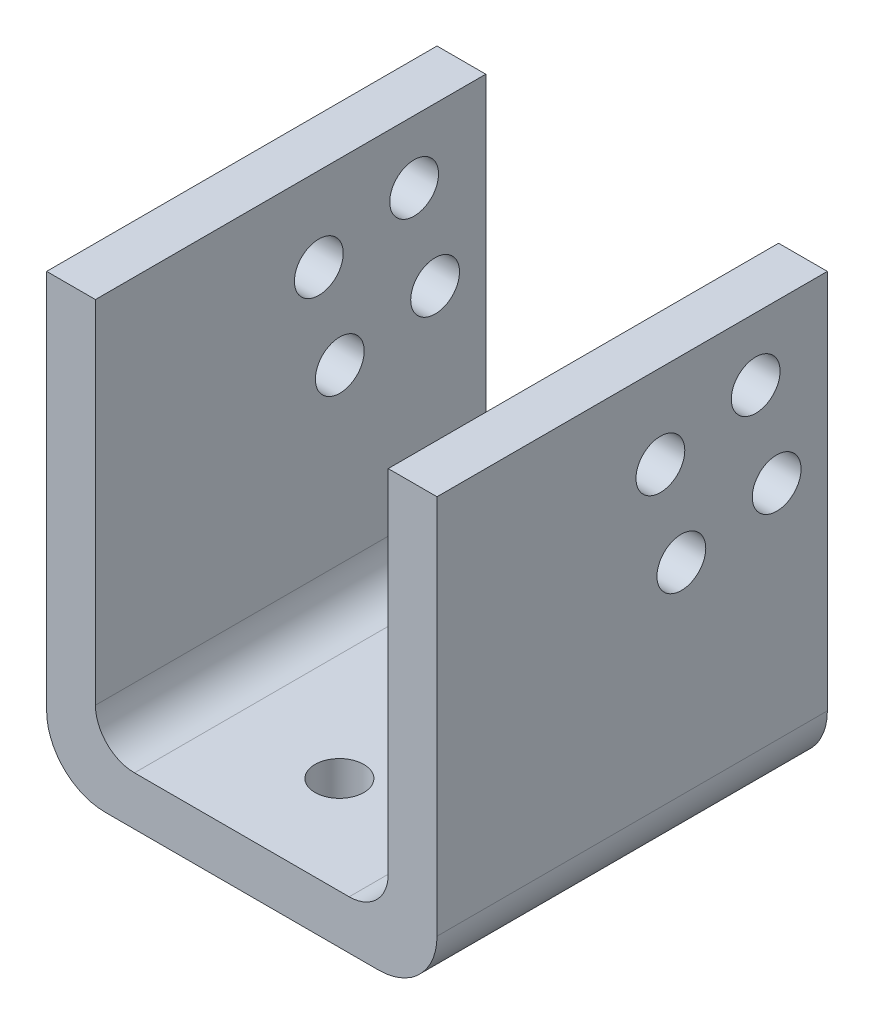
ISO-10303-21;
HEADER;
FILE_DESCRIPTION(('STEP AP214'),'2;1');
FILE_NAME('part.step','',(''),(''),'','','');
FILE_SCHEMA(('AUTOMOTIVE_DESIGN { 1 0 10303 214 1 1 1 1 }'));
ENDSEC;
DATA;
#1=APPLICATION_CONTEXT('core data for automotive mechanical design processes');
#2=APPLICATION_PROTOCOL_DEFINITION('international standard','automotive_design',2000,#1);
#3=PRODUCT_CONTEXT('',#1,'mechanical');
#4=PRODUCT('Part','Part','',(#3));
#5=PRODUCT_RELATED_PRODUCT_CATEGORY('part','',(#4));
#6=PRODUCT_DEFINITION_FORMATION('','',#4);
#7=PRODUCT_DEFINITION_CONTEXT('part definition',#1,'design');
#8=PRODUCT_DEFINITION('design','',#6,#7);
#9=PRODUCT_DEFINITION_SHAPE('','',#8);
#10=(LENGTH_UNIT() NAMED_UNIT(*) SI_UNIT(.MILLI.,.METRE.));
#11=(NAMED_UNIT(*) PLANE_ANGLE_UNIT() SI_UNIT($,.RADIAN.));
#12=(NAMED_UNIT(*) SI_UNIT($,.STERADIAN.) SOLID_ANGLE_UNIT());
#13=UNCERTAINTY_MEASURE_WITH_UNIT(LENGTH_MEASURE(1.E-05),#10,'distance_accuracy_value','');
#14=(GEOMETRIC_REPRESENTATION_CONTEXT(3) GLOBAL_UNCERTAINTY_ASSIGNED_CONTEXT((#13)) GLOBAL_UNIT_ASSIGNED_CONTEXT((#10,
#11,#12)) REPRESENTATION_CONTEXT('',''));
#15=CARTESIAN_POINT('',(0.,0.,0.));
#16=DIRECTION('',(0.,0.,1.));
#17=DIRECTION('',(1.,0.,0.));
#18=AXIS2_PLACEMENT_3D('',#15,#16,#17);
#19=CARTESIAN_POINT('',(40.,0.,40.));
#20=DIRECTION('',(0.,1.,0.));
#21=DIRECTION('',(-1.,0.,0.));
#22=AXIS2_PLACEMENT_3D('',#19,#20,#21);
#23=PLANE('',#22);
#24=DIRECTION('',(1.,0.,0.));
#25=VECTOR('',#24,1.);
#26=CARTESIAN_POINT('',(40.,0.,0.));
#27=LINE('',#26,#25);
#28=CARTESIAN_POINT('',(6.,0.,0.));
#29=VERTEX_POINT('',#28);
#30=CARTESIAN_POINT('',(34.,0.,0.));
#31=VERTEX_POINT('',#30);
#32=EDGE_CURVE('E162',#29,#31,#27,.T.);
#33=ORIENTED_EDGE('',*,*,#32,.T.);
#34=DIRECTION('',(0.,0.,-1.));
#35=VECTOR('',#34,1.);
#36=CARTESIAN_POINT('',(34.,0.,40.));
#37=LINE('',#36,#35);
#38=CARTESIAN_POINT('',(34.,0.,40.));
#39=VERTEX_POINT('',#38);
#40=EDGE_CURVE('E196',#31,#39,#37,.F.);
#41=ORIENTED_EDGE('',*,*,#40,.T.);
#42=DIRECTION('',(1.,0.,0.));
#43=VECTOR('',#42,1.);
#44=CARTESIAN_POINT('',(40.,0.,40.));
#45=LINE('',#44,#43);
#46=CARTESIAN_POINT('',(6.,0.,40.));
#47=VERTEX_POINT('',#46);
#48=EDGE_CURVE('E132',#47,#39,#45,.T.);
#49=ORIENTED_EDGE('',*,*,#48,.F.);
#50=DIRECTION('',(0.,0.,-1.));
#51=VECTOR('',#50,1.);
#52=CARTESIAN_POINT('',(6.,0.,40.));
#53=LINE('',#52,#51);
#54=EDGE_CURVE('E193',#47,#29,#53,.T.);
#55=ORIENTED_EDGE('',*,*,#54,.T.);
#56=EDGE_LOOP('',(#33,#41,#49,#55));
#57=FACE_BOUND('',#56,.T.);
#58=CARTESIAN_POINT('',(20.,0.,10.));
#59=DIRECTION('',(0.,-1.,0.));
#60=DIRECTION('',(1.,0.,0.));
#61=AXIS2_PLACEMENT_3D('',#58,#59,#60);
#62=CIRCLE('',#61,2.5);
#63=CARTESIAN_POINT('',(22.5,0.,10.));
#64=VERTEX_POINT('',#63);
#65=EDGE_CURVE('E295',#64,#64,#62,.F.);
#66=ORIENTED_EDGE('',*,*,#65,.T.);
#67=EDGE_LOOP('',(#66));
#68=FACE_BOUND('',#67,.T.);
#69=CARTESIAN_POINT('',(20.,0.,30.));
#70=DIRECTION('',(0.,-1.,0.));
#71=DIRECTION('',(1.,0.,0.));
#72=AXIS2_PLACEMENT_3D('',#69,#70,#71);
#73=CIRCLE('',#72,2.5);
#74=CARTESIAN_POINT('',(22.5,0.,30.));
#75=VERTEX_POINT('',#74);
#76=EDGE_CURVE('E301',#75,#75,#73,.T.);
#77=ORIENTED_EDGE('',*,*,#76,.F.);
#78=EDGE_LOOP('',(#77));
#79=FACE_BOUND('',#78,.T.);
#80=ADVANCED_FACE('F33',(#57,#68,#79),#23,.F.);
#81=CARTESIAN_POINT('',(5.,5.,40.));
#82=DIRECTION('',(0.,-1.,0.));
#83=DIRECTION('',(0.,0.,-1.));
#84=AXIS2_PLACEMENT_3D('',#81,#82,#83);
#85=PLANE('',#84);
#86=DIRECTION('',(-1.,0.,0.));
#87=VECTOR('',#86,1.);
#88=CARTESIAN_POINT('',(5.,5.,40.));
#89=LINE('',#88,#87);
#90=CARTESIAN_POINT('',(31.,5.,40.));
#91=VERTEX_POINT('',#90);
#92=CARTESIAN_POINT('',(9.00000000000001,5.,40.));
#93=VERTEX_POINT('',#92);
#94=EDGE_CURVE('E149',#91,#93,#89,.T.);
#95=ORIENTED_EDGE('',*,*,#94,.F.);
#96=DIRECTION('',(0.,0.,-1.));
#97=VECTOR('',#96,1.);
#98=CARTESIAN_POINT('',(31.,5.,0.));
#99=LINE('',#98,#97);
#100=CARTESIAN_POINT('',(31.,5.,0.));
#101=VERTEX_POINT('',#100);
#102=EDGE_CURVE('E205',#91,#101,#99,.T.);
#103=ORIENTED_EDGE('',*,*,#102,.T.);
#104=DIRECTION('',(-1.,0.,0.));
#105=VECTOR('',#104,1.);
#106=CARTESIAN_POINT('',(5.,5.,0.));
#107=LINE('',#106,#105);
#108=CARTESIAN_POINT('',(9.00000000000001,5.,0.));
#109=VERTEX_POINT('',#108);
#110=EDGE_CURVE('E172',#101,#109,#107,.T.);
#111=ORIENTED_EDGE('',*,*,#110,.T.);
#112=DIRECTION('',(0.,0.,-1.));
#113=VECTOR('',#112,1.);
#114=CARTESIAN_POINT('',(9.00000000000001,5.,40.));
#115=LINE('',#114,#113);
#116=EDGE_CURVE('E203',#109,#93,#115,.F.);
#117=ORIENTED_EDGE('',*,*,#116,.T.);
#118=EDGE_LOOP('',(#95,#103,#111,#117));
#119=FACE_BOUND('',#118,.T.);
#120=CARTESIAN_POINT('',(20.,5.,10.));
#121=DIRECTION('',(0.,-1.,0.));
#122=DIRECTION('',(1.,0.,0.));
#123=AXIS2_PLACEMENT_3D('',#120,#121,#122);
#124=CIRCLE('',#123,2.5);
#125=CARTESIAN_POINT('',(22.5,5.,10.));
#126=VERTEX_POINT('',#125);
#127=EDGE_CURVE('E298',#126,#126,#124,.F.);
#128=ORIENTED_EDGE('',*,*,#127,.F.);
#129=EDGE_LOOP('',(#128));
#130=FACE_BOUND('',#129,.T.);
#131=CARTESIAN_POINT('',(20.,5.,30.));
#132=DIRECTION('',(0.,-1.,0.));
#133=DIRECTION('',(1.,0.,0.));
#134=AXIS2_PLACEMENT_3D('',#131,#132,#133);
#135=CIRCLE('',#134,2.5);
#136=CARTESIAN_POINT('',(22.5,5.,30.));
#137=VERTEX_POINT('',#136);
#138=EDGE_CURVE('E290',#137,#137,#135,.T.);
#139=ORIENTED_EDGE('',*,*,#138,.T.);
#140=EDGE_LOOP('',(#139));
#141=FACE_BOUND('',#140,.T.);
#142=ADVANCED_FACE('F222',(#119,#130,#141),#85,.F.);
#143=CARTESIAN_POINT('',(40.,45.,40.));
#144=DIRECTION('',(-1.,0.,0.));
#145=DIRECTION('',(0.,-1.,0.));
#146=AXIS2_PLACEMENT_3D('',#143,#144,#145);
#147=PLANE('',#146);
#148=CARTESIAN_POINT('',(40.,28.8106379692022,5.19389489102103));
#149=DIRECTION('',(-1.,0.,0.));
#150=DIRECTION('',(0.,-1.,0.));
#151=AXIS2_PLACEMENT_3D('',#148,#149,#150);
#152=CIRCLE('',#151,2.5);
#153=CARTESIAN_POINT('',(40.,26.3106379692022,5.19389489102103));
#154=VERTEX_POINT('',#153);
#155=EDGE_CURVE('E165',#154,#154,#152,.T.);
#156=ORIENTED_EDGE('',*,*,#155,.T.);
#157=EDGE_LOOP('',(#156));
#158=FACE_BOUND('',#157,.T.);
#159=CARTESIAN_POINT('',(40.,26.6616743866881,14.9602634853875));
#160=DIRECTION('',(-1.,0.,0.));
#161=DIRECTION('',(0.,-1.,0.));
#162=AXIS2_PLACEMENT_3D('',#159,#160,#161);
#163=CIRCLE('',#162,2.5);
#164=CARTESIAN_POINT('',(40.,24.1616743866881,14.9602634853875));
#165=VERTEX_POINT('',#164);
#166=EDGE_CURVE('E255',#165,#165,#163,.T.);
#167=ORIENTED_EDGE('',*,*,#166,.T.);
#168=EDGE_LOOP('',(#167));
#169=FACE_BOUND('',#168,.T.);
#170=CARTESIAN_POINT('',(40.,36.4280429810546,17.1092270679017));
#171=DIRECTION('',(-1.,0.,0.));
#172=DIRECTION('',(0.,-1.,0.));
#173=AXIS2_PLACEMENT_3D('',#170,#171,#172);
#174=CIRCLE('',#173,2.5);
#175=CARTESIAN_POINT('',(40.,33.9280429810546,17.1092270679017));
#176=VERTEX_POINT('',#175);
#177=EDGE_CURVE('E264',#176,#176,#174,.T.);
#178=ORIENTED_EDGE('',*,*,#177,.T.);
#179=EDGE_LOOP('',(#178));
#180=FACE_BOUND('',#179,.T.);
#181=CARTESIAN_POINT('',(40.,38.5770065635687,7.34285847353518));
#182=DIRECTION('',(-1.,0.,0.));
#183=DIRECTION('',(0.,-1.,0.));
#184=AXIS2_PLACEMENT_3D('',#181,#182,#183);
#185=CIRCLE('',#184,2.5);
#186=CARTESIAN_POINT('',(40.,36.0770065635687,7.34285847353518));
#187=VERTEX_POINT('',#186);
#188=EDGE_CURVE('E273',#187,#187,#185,.T.);
#189=ORIENTED_EDGE('',*,*,#188,.T.);
#190=EDGE_LOOP('',(#189));
#191=FACE_BOUND('',#190,.T.);
#192=DIRECTION('',(0.,1.,0.));
#193=VECTOR('',#192,1.);
#194=CARTESIAN_POINT('',(40.,45.,40.));
#195=LINE('',#194,#193);
#196=CARTESIAN_POINT('',(40.,6.00000000000001,40.));
#197=VERTEX_POINT('',#196);
#198=CARTESIAN_POINT('',(40.,45.,40.));
#199=VERTEX_POINT('',#198);
#200=EDGE_CURVE('E119',#197,#199,#195,.T.);
#201=ORIENTED_EDGE('',*,*,#200,.F.);
#202=DIRECTION('',(0.,0.,-1.));
#203=VECTOR('',#202,1.);
#204=CARTESIAN_POINT('',(40.,6.,40.));
#205=LINE('',#204,#203);
#206=CARTESIAN_POINT('',(40.,6.00000000000001,0.));
#207=VERTEX_POINT('',#206);
#208=EDGE_CURVE('E141',#197,#207,#205,.T.);
#209=ORIENTED_EDGE('',*,*,#208,.T.);
#210=DIRECTION('',(0.,1.,0.));
#211=VECTOR('',#210,1.);
#212=CARTESIAN_POINT('',(40.,45.,0.));
#213=LINE('',#212,#211);
#214=CARTESIAN_POINT('',(40.,45.,0.));
#215=VERTEX_POINT('',#214);
#216=EDGE_CURVE('E138',#207,#215,#213,.T.);
#217=ORIENTED_EDGE('',*,*,#216,.T.);
#218=DIRECTION('',(0.,0.,-1.));
#219=VECTOR('',#218,1.);
#220=CARTESIAN_POINT('',(40.,45.,40.));
#221=LINE('',#220,#219);
#222=EDGE_CURVE('E135',#199,#215,#221,.T.);
#223=ORIENTED_EDGE('',*,*,#222,.F.);
#224=EDGE_LOOP('',(#201,#209,#217,#223));
#225=FACE_BOUND('',#224,.T.);
#226=ADVANCED_FACE('F136',(#158,#169,#180,#191,#225),#147,.F.);
#227=CARTESIAN_POINT('',(35.,45.,40.));
#228=DIRECTION('',(0.,-1.,0.));
#229=DIRECTION('',(0.,0.,-1.));
#230=AXIS2_PLACEMENT_3D('',#227,#228,#229);
#231=PLANE('',#230);
#232=DIRECTION('',(-1.,0.,0.));
#233=VECTOR('',#232,1.);
#234=CARTESIAN_POINT('',(35.,45.,0.));
#235=LINE('',#234,#233);
#236=CARTESIAN_POINT('',(35.,45.,0.));
#237=VERTEX_POINT('',#236);
#238=EDGE_CURVE('E167',#215,#237,#235,.T.);
#239=ORIENTED_EDGE('',*,*,#238,.T.);
#240=DIRECTION('',(0.,0.,-1.));
#241=VECTOR('',#240,1.);
#242=CARTESIAN_POINT('',(35.,45.,40.));
#243=LINE('',#242,#241);
#244=CARTESIAN_POINT('',(35.,45.,40.));
#245=VERTEX_POINT('',#244);
#246=EDGE_CURVE('E142',#245,#237,#243,.T.);
#247=ORIENTED_EDGE('',*,*,#246,.F.);
#248=DIRECTION('',(-1.,0.,0.));
#249=VECTOR('',#248,1.);
#250=CARTESIAN_POINT('',(35.,45.,40.));
#251=LINE('',#250,#249);
#252=EDGE_CURVE('E125',#199,#245,#251,.T.);
#253=ORIENTED_EDGE('',*,*,#252,.F.);
#254=ORIENTED_EDGE('',*,*,#222,.T.);
#255=EDGE_LOOP('',(#239,#247,#253,#254));
#256=FACE_BOUND('',#255,.T.);
#257=ADVANCED_FACE('F144',(#256),#231,.F.);
#258=CARTESIAN_POINT('',(35.,5.,40.));
#259=DIRECTION('',(1.,0.,0.));
#260=DIRECTION('',(0.,1.,0.));
#261=AXIS2_PLACEMENT_3D('',#258,#259,#260);
#262=PLANE('',#261);
#263=CARTESIAN_POINT('',(35.,28.8106379692022,5.19389489102103));
#264=DIRECTION('',(1.,0.,0.));
#265=DIRECTION('',(0.,1.,0.));
#266=AXIS2_PLACEMENT_3D('',#263,#264,#265);
#267=CIRCLE('',#266,2.5);
#268=CARTESIAN_POINT('',(35.,31.3106379692022,5.19389489102103));
#269=VERTEX_POINT('',#268);
#270=EDGE_CURVE('E249',#269,#269,#267,.T.);
#271=ORIENTED_EDGE('',*,*,#270,.T.);
#272=EDGE_LOOP('',(#271));
#273=FACE_BOUND('',#272,.T.);
#274=CARTESIAN_POINT('',(35.,26.6616743866881,14.9602634853875));
#275=DIRECTION('',(1.,0.,0.));
#276=DIRECTION('',(0.,1.,0.));
#277=AXIS2_PLACEMENT_3D('',#274,#275,#276);
#278=CIRCLE('',#277,2.5);
#279=CARTESIAN_POINT('',(35.,29.1616743866881,14.9602634853875));
#280=VERTEX_POINT('',#279);
#281=EDGE_CURVE('E258',#280,#280,#278,.T.);
#282=ORIENTED_EDGE('',*,*,#281,.T.);
#283=EDGE_LOOP('',(#282));
#284=FACE_BOUND('',#283,.T.);
#285=CARTESIAN_POINT('',(35.,36.4280429810546,17.1092270679017));
#286=DIRECTION('',(1.,0.,0.));
#287=DIRECTION('',(0.,1.,0.));
#288=AXIS2_PLACEMENT_3D('',#285,#286,#287);
#289=CIRCLE('',#288,2.5);
#290=CARTESIAN_POINT('',(35.,38.9280429810546,17.1092270679017));
#291=VERTEX_POINT('',#290);
#292=EDGE_CURVE('E267',#291,#291,#289,.T.);
#293=ORIENTED_EDGE('',*,*,#292,.T.);
#294=EDGE_LOOP('',(#293));
#295=FACE_BOUND('',#294,.T.);
#296=CARTESIAN_POINT('',(35.,38.5770065635687,7.34285847353518));
#297=DIRECTION('',(1.,0.,0.));
#298=DIRECTION('',(0.,1.,0.));
#299=AXIS2_PLACEMENT_3D('',#296,#297,#298);
#300=CIRCLE('',#299,2.5);
#301=CARTESIAN_POINT('',(35.,41.0770065635687,7.34285847353518));
#302=VERTEX_POINT('',#301);
#303=EDGE_CURVE('E276',#302,#302,#300,.T.);
#304=ORIENTED_EDGE('',*,*,#303,.T.);
#305=EDGE_LOOP('',(#304));
#306=FACE_BOUND('',#305,.T.);
#307=DIRECTION('',(0.,-1.,0.));
#308=VECTOR('',#307,1.);
#309=CARTESIAN_POINT('',(35.,5.,0.));
#310=LINE('',#309,#308);
#311=CARTESIAN_POINT('',(35.,9.,0.));
#312=VERTEX_POINT('',#311);
#313=EDGE_CURVE('E169',#237,#312,#310,.T.);
#314=ORIENTED_EDGE('',*,*,#313,.T.);
#315=DIRECTION('',(0.,0.,-1.));
#316=VECTOR('',#315,1.);
#317=CARTESIAN_POINT('',(35.,9.,40.));
#318=LINE('',#317,#316);
#319=CARTESIAN_POINT('',(35.,9.,40.));
#320=VERTEX_POINT('',#319);
#321=EDGE_CURVE('E208',#312,#320,#318,.F.);
#322=ORIENTED_EDGE('',*,*,#321,.T.);
#323=DIRECTION('',(0.,-1.,0.));
#324=VECTOR('',#323,1.);
#325=CARTESIAN_POINT('',(35.,5.,40.));
#326=LINE('',#325,#324);
#327=EDGE_CURVE('E147',#245,#320,#326,.T.);
#328=ORIENTED_EDGE('',*,*,#327,.F.);
#329=ORIENTED_EDGE('',*,*,#246,.T.);
#330=EDGE_LOOP('',(#314,#322,#328,#329));
#331=FACE_BOUND('',#330,.T.);
#332=ADVANCED_FACE('F345',(#273,#284,#295,#306,#331),#262,.F.);
#333=CARTESIAN_POINT('',(5.,45.,40.));
#334=DIRECTION('',(-1.,0.,0.));
#335=DIRECTION('',(0.,-1.,0.));
#336=AXIS2_PLACEMENT_3D('',#333,#334,#335);
#337=PLANE('',#336);
#338=CARTESIAN_POINT('',(5.,28.8106379692022,5.19389489102103));
#339=DIRECTION('',(-1.,0.,0.));
#340=DIRECTION('',(0.,-1.,0.));
#341=AXIS2_PLACEMENT_3D('',#338,#339,#340);
#342=CIRCLE('',#341,2.5);
#343=CARTESIAN_POINT('',(5.,26.3106379692022,5.19389489102103));
#344=VERTEX_POINT('',#343);
#345=EDGE_CURVE('E252',#344,#344,#342,.T.);
#346=ORIENTED_EDGE('',*,*,#345,.T.);
#347=EDGE_LOOP('',(#346));
#348=FACE_BOUND('',#347,.T.);
#349=CARTESIAN_POINT('',(5.,26.6616743866881,14.9602634853875));
#350=DIRECTION('',(-1.,0.,0.));
#351=DIRECTION('',(0.,-1.,0.));
#352=AXIS2_PLACEMENT_3D('',#349,#350,#351);
#353=CIRCLE('',#352,2.5);
#354=CARTESIAN_POINT('',(5.,24.1616743866881,14.9602634853875));
#355=VERTEX_POINT('',#354);
#356=EDGE_CURVE('E261',#355,#355,#353,.T.);
#357=ORIENTED_EDGE('',*,*,#356,.T.);
#358=EDGE_LOOP('',(#357));
#359=FACE_BOUND('',#358,.T.);
#360=CARTESIAN_POINT('',(5.,36.4280429810546,17.1092270679017));
#361=DIRECTION('',(-1.,0.,0.));
#362=DIRECTION('',(0.,-1.,0.));
#363=AXIS2_PLACEMENT_3D('',#360,#361,#362);
#364=CIRCLE('',#363,2.5);
#365=CARTESIAN_POINT('',(5.,33.9280429810546,17.1092270679017));
#366=VERTEX_POINT('',#365);
#367=EDGE_CURVE('E270',#366,#366,#364,.T.);
#368=ORIENTED_EDGE('',*,*,#367,.T.);
#369=EDGE_LOOP('',(#368));
#370=FACE_BOUND('',#369,.T.);
#371=CARTESIAN_POINT('',(5.,38.5770065635687,7.34285847353518));
#372=DIRECTION('',(-1.,0.,0.));
#373=DIRECTION('',(0.,-1.,0.));
#374=AXIS2_PLACEMENT_3D('',#371,#372,#373);
#375=CIRCLE('',#374,2.5);
#376=CARTESIAN_POINT('',(5.,36.0770065635687,7.34285847353518));
#377=VERTEX_POINT('',#376);
#378=EDGE_CURVE('E279',#377,#377,#375,.T.);
#379=ORIENTED_EDGE('',*,*,#378,.T.);
#380=EDGE_LOOP('',(#379));
#381=FACE_BOUND('',#380,.T.);
#382=DIRECTION('',(0.,1.,0.));
#383=VECTOR('',#382,1.);
#384=CARTESIAN_POINT('',(5.,45.,40.));
#385=LINE('',#384,#383);
#386=CARTESIAN_POINT('',(5.,8.99999999999999,40.));
#387=VERTEX_POINT('',#386);
#388=CARTESIAN_POINT('',(5.,45.,40.));
#389=VERTEX_POINT('',#388);
#390=EDGE_CURVE('E154',#387,#389,#385,.T.);
#391=ORIENTED_EDGE('',*,*,#390,.F.);
#392=DIRECTION('',(0.,0.,-1.));
#393=VECTOR('',#392,1.);
#394=CARTESIAN_POINT('',(5.,8.99999999999999,0.));
#395=LINE('',#394,#393);
#396=CARTESIAN_POINT('',(5.,8.99999999999999,0.));
#397=VERTEX_POINT('',#396);
#398=EDGE_CURVE('E210',#387,#397,#395,.T.);
#399=ORIENTED_EDGE('',*,*,#398,.T.);
#400=DIRECTION('',(0.,1.,0.));
#401=VECTOR('',#400,1.);
#402=CARTESIAN_POINT('',(5.,45.,0.));
#403=LINE('',#402,#401);
#404=CARTESIAN_POINT('',(5.,45.,0.));
#405=VERTEX_POINT('',#404);
#406=EDGE_CURVE('E175',#397,#405,#403,.T.);
#407=ORIENTED_EDGE('',*,*,#406,.T.);
#408=DIRECTION('',(0.,0.,-1.));
#409=VECTOR('',#408,1.);
#410=CARTESIAN_POINT('',(5.,45.,40.));
#411=LINE('',#410,#409);
#412=EDGE_CURVE('E184',#389,#405,#411,.T.);
#413=ORIENTED_EDGE('',*,*,#412,.F.);
#414=EDGE_LOOP('',(#391,#399,#407,#413));
#415=FACE_BOUND('',#414,.T.);
#416=ADVANCED_FACE('F226',(#348,#359,#370,#381,#415),#337,.F.);
#417=CARTESIAN_POINT('',(0.,45.,40.));
#418=DIRECTION('',(0.,-1.,0.));
#419=DIRECTION('',(0.,0.,-1.));
#420=AXIS2_PLACEMENT_3D('',#417,#418,#419);
#421=PLANE('',#420);
#422=DIRECTION('',(-1.,0.,0.));
#423=VECTOR('',#422,1.);
#424=CARTESIAN_POINT('',(0.,45.,0.));
#425=LINE('',#424,#423);
#426=CARTESIAN_POINT('',(0.,45.,0.));
#427=VERTEX_POINT('',#426);
#428=EDGE_CURVE('E177',#405,#427,#425,.T.);
#429=ORIENTED_EDGE('',*,*,#428,.T.);
#430=DIRECTION('',(0.,0.,-1.));
#431=VECTOR('',#430,1.);
#432=CARTESIAN_POINT('',(0.,45.,40.));
#433=LINE('',#432,#431);
#434=CARTESIAN_POINT('',(0.,45.,40.));
#435=VERTEX_POINT('',#434);
#436=EDGE_CURVE('E161',#435,#427,#433,.T.);
#437=ORIENTED_EDGE('',*,*,#436,.F.);
#438=DIRECTION('',(-1.,0.,0.));
#439=VECTOR('',#438,1.);
#440=CARTESIAN_POINT('',(0.,45.,40.));
#441=LINE('',#440,#439);
#442=EDGE_CURVE('E156',#389,#435,#441,.T.);
#443=ORIENTED_EDGE('',*,*,#442,.F.);
#444=ORIENTED_EDGE('',*,*,#412,.T.);
#445=EDGE_LOOP('',(#429,#437,#443,#444));
#446=FACE_BOUND('',#445,.T.);
#447=ADVANCED_FACE('F233',(#446),#421,.F.);
#448=CARTESIAN_POINT('',(0.,0.,40.));
#449=DIRECTION('',(1.,0.,0.));
#450=DIRECTION('',(0.,0.,-1.));
#451=AXIS2_PLACEMENT_3D('',#448,#449,#450);
#452=PLANE('',#451);
#453=CARTESIAN_POINT('',(0.,28.8106379692022,5.19389489102103));
#454=DIRECTION('',(-1.,0.,0.));
#455=DIRECTION('',(0.,0.,1.));
#456=AXIS2_PLACEMENT_3D('',#453,#454,#455);
#457=CIRCLE('',#456,2.5);
#458=CARTESIAN_POINT('',(0.,28.8106379692022,7.69389489102102));
#459=VERTEX_POINT('',#458);
#460=EDGE_CURVE('E286',#459,#459,#457,.T.);
#461=ORIENTED_EDGE('',*,*,#460,.F.);
#462=EDGE_LOOP('',(#461));
#463=FACE_BOUND('',#462,.T.);
#464=CARTESIAN_POINT('',(0.,26.6616743866881,14.9602634853875));
#465=DIRECTION('',(-1.,0.,0.));
#466=DIRECTION('',(0.,0.,1.));
#467=AXIS2_PLACEMENT_3D('',#464,#465,#466);
#468=CIRCLE('',#467,2.5);
#469=CARTESIAN_POINT('',(0.,26.6616743866881,17.4602634853875));
#470=VERTEX_POINT('',#469);
#471=EDGE_CURVE('E289',#470,#470,#468,.T.);
#472=ORIENTED_EDGE('',*,*,#471,.F.);
#473=EDGE_LOOP('',(#472));
#474=FACE_BOUND('',#473,.T.);
#475=CARTESIAN_POINT('',(0.,36.4280429810546,17.1092270679017));
#476=DIRECTION('',(-1.,0.,0.));
#477=DIRECTION('',(0.,0.,1.));
#478=AXIS2_PLACEMENT_3D('',#475,#476,#477);
#479=CIRCLE('',#478,2.5);
#480=CARTESIAN_POINT('',(0.,36.4280429810546,19.6092270679017));
#481=VERTEX_POINT('',#480);
#482=EDGE_CURVE('E285',#481,#481,#479,.T.);
#483=ORIENTED_EDGE('',*,*,#482,.F.);
#484=EDGE_LOOP('',(#483));
#485=FACE_BOUND('',#484,.T.);
#486=CARTESIAN_POINT('',(0.,38.5770065635687,7.34285847353518));
#487=DIRECTION('',(-1.,0.,0.));
#488=DIRECTION('',(0.,0.,1.));
#489=AXIS2_PLACEMENT_3D('',#486,#487,#488);
#490=CIRCLE('',#489,2.5);
#491=CARTESIAN_POINT('',(0.,38.5770065635687,9.84285847353518));
#492=VERTEX_POINT('',#491);
#493=EDGE_CURVE('E282',#492,#492,#490,.T.);
#494=ORIENTED_EDGE('',*,*,#493,.F.);
#495=EDGE_LOOP('',(#494));
#496=FACE_BOUND('',#495,.T.);
#497=DIRECTION('',(0.,-1.,0.));
#498=VECTOR('',#497,1.);
#499=CARTESIAN_POINT('',(0.,0.,0.));
#500=LINE('',#499,#498);
#501=CARTESIAN_POINT('',(0.,6.,0.));
#502=VERTEX_POINT('',#501);
#503=EDGE_CURVE('E179',#427,#502,#500,.T.);
#504=ORIENTED_EDGE('',*,*,#503,.T.);
#505=DIRECTION('',(0.,0.,-1.));
#506=VECTOR('',#505,1.);
#507=CARTESIAN_POINT('',(0.,6.,40.));
#508=LINE('',#507,#506);
#509=CARTESIAN_POINT('',(0.,6.,40.));
#510=VERTEX_POINT('',#509);
#511=EDGE_CURVE('E201',#502,#510,#508,.F.);
#512=ORIENTED_EDGE('',*,*,#511,.T.);
#513=DIRECTION('',(0.,-1.,0.));
#514=VECTOR('',#513,1.);
#515=CARTESIAN_POINT('',(0.,0.,40.));
#516=LINE('',#515,#514);
#517=EDGE_CURVE('E158',#435,#510,#516,.T.);
#518=ORIENTED_EDGE('',*,*,#517,.F.);
#519=ORIENTED_EDGE('',*,*,#436,.T.);
#520=EDGE_LOOP('',(#504,#512,#518,#519));
#521=FACE_BOUND('',#520,.T.);
#522=ADVANCED_FACE('F236',(#463,#474,#485,#496,#521),#452,.F.);
#523=CARTESIAN_POINT('',(0.,0.,40.));
#524=DIRECTION('',(0.,0.,-1.));
#525=DIRECTION('',(-1.,0.,0.));
#526=AXIS2_PLACEMENT_3D('',#523,#524,#525);
#527=PLANE('',#526);
#528=ORIENTED_EDGE('',*,*,#48,.T.);
#529=CARTESIAN_POINT('',(34.,6.,40.));
#530=DIRECTION('',(0.,0.,-1.));
#531=DIRECTION('',(-1.,0.,0.));
#532=AXIS2_PLACEMENT_3D('',#529,#530,#531);
#533=CIRCLE('',#532,6.);
#534=EDGE_CURVE('E128',#39,#197,#533,.F.);
#535=ORIENTED_EDGE('',*,*,#534,.T.);
#536=ORIENTED_EDGE('',*,*,#200,.T.);
#537=ORIENTED_EDGE('',*,*,#252,.T.);
#538=ORIENTED_EDGE('',*,*,#327,.T.);
#539=CARTESIAN_POINT('',(31.,9.,40.));
#540=DIRECTION('',(0.,0.,-1.));
#541=DIRECTION('',(-1.,0.,0.));
#542=AXIS2_PLACEMENT_3D('',#539,#540,#541);
#543=CIRCLE('',#542,4.);
#544=EDGE_CURVE('E214',#320,#91,#543,.T.);
#545=ORIENTED_EDGE('',*,*,#544,.T.);
#546=ORIENTED_EDGE('',*,*,#94,.T.);
#547=CARTESIAN_POINT('',(9.00000000000001,8.99999999999999,40.));
#548=DIRECTION('',(0.,0.,-1.));
#549=DIRECTION('',(-1.,0.,0.));
#550=AXIS2_PLACEMENT_3D('',#547,#548,#549);
#551=CIRCLE('',#550,4.);
#552=EDGE_CURVE('E11',#93,#387,#551,.T.);
#553=ORIENTED_EDGE('',*,*,#552,.T.);
#554=ORIENTED_EDGE('',*,*,#390,.T.);
#555=ORIENTED_EDGE('',*,*,#442,.T.);
#556=ORIENTED_EDGE('',*,*,#517,.T.);
#557=CARTESIAN_POINT('',(6.,6.,40.));
#558=DIRECTION('',(0.,0.,-1.));
#559=DIRECTION('',(-1.,0.,0.));
#560=AXIS2_PLACEMENT_3D('',#557,#558,#559);
#561=CIRCLE('',#560,6.);
#562=EDGE_CURVE('E198',#510,#47,#561,.F.);
#563=ORIENTED_EDGE('',*,*,#562,.T.);
#564=EDGE_LOOP('',(#528,#535,#536,#537,#538,#545,#546,#553,#554,#555,#556,#563));
#565=FACE_BOUND('',#564,.T.);
#566=ADVANCED_FACE('F122',(#565),#527,.F.);
#567=CARTESIAN_POINT('',(0.,0.,0.));
#568=DIRECTION('',(0.,0.,-1.));
#569=DIRECTION('',(-1.,0.,0.));
#570=AXIS2_PLACEMENT_3D('',#567,#568,#569);
#571=PLANE('',#570);
#572=ORIENTED_EDGE('',*,*,#216,.F.);
#573=CARTESIAN_POINT('',(34.,6.,0.));
#574=DIRECTION('',(0.,0.,-1.));
#575=DIRECTION('',(-1.,0.,0.));
#576=AXIS2_PLACEMENT_3D('',#573,#574,#575);
#577=CIRCLE('',#576,6.);
#578=EDGE_CURVE('E191',#207,#31,#577,.T.);
#579=ORIENTED_EDGE('',*,*,#578,.T.);
#580=ORIENTED_EDGE('',*,*,#32,.F.);
#581=CARTESIAN_POINT('',(6.,6.,0.));
#582=DIRECTION('',(0.,0.,-1.));
#583=DIRECTION('',(-1.,0.,0.));
#584=AXIS2_PLACEMENT_3D('',#581,#582,#583);
#585=CIRCLE('',#584,6.);
#586=EDGE_CURVE('E189',#29,#502,#585,.T.);
#587=ORIENTED_EDGE('',*,*,#586,.T.);
#588=ORIENTED_EDGE('',*,*,#503,.F.);
#589=ORIENTED_EDGE('',*,*,#428,.F.);
#590=ORIENTED_EDGE('',*,*,#406,.F.);
#591=CARTESIAN_POINT('',(9.00000000000001,8.99999999999999,0.));
#592=DIRECTION('',(0.,0.,-1.));
#593=DIRECTION('',(-1.,0.,0.));
#594=AXIS2_PLACEMENT_3D('',#591,#592,#593);
#595=CIRCLE('',#594,4.);
#596=EDGE_CURVE('E41',#397,#109,#595,.F.);
#597=ORIENTED_EDGE('',*,*,#596,.T.);
#598=ORIENTED_EDGE('',*,*,#110,.F.);
#599=CARTESIAN_POINT('',(31.,9.,0.));
#600=DIRECTION('',(0.,0.,-1.));
#601=DIRECTION('',(-1.,0.,0.));
#602=AXIS2_PLACEMENT_3D('',#599,#600,#601);
#603=CIRCLE('',#602,4.);
#604=EDGE_CURVE('E212',#101,#312,#603,.F.);
#605=ORIENTED_EDGE('',*,*,#604,.T.);
#606=ORIENTED_EDGE('',*,*,#313,.F.);
#607=ORIENTED_EDGE('',*,*,#238,.F.);
#608=EDGE_LOOP('',(#572,#579,#580,#587,#588,#589,#590,#597,#598,#605,#606,#607));
#609=FACE_BOUND('',#608,.T.);
#610=ADVANCED_FACE('F218',(#609),#571,.T.);
#611=CARTESIAN_POINT('',(34.,6.,40.));
#612=DIRECTION('',(0.,0.,-1.));
#613=DIRECTION('',(-1.,0.,0.));
#614=AXIS2_PLACEMENT_3D('',#611,#612,#613);
#615=CYLINDRICAL_SURFACE('',#614,6.);
#616=ORIENTED_EDGE('',*,*,#534,.F.);
#617=ORIENTED_EDGE('',*,*,#40,.F.);
#618=ORIENTED_EDGE('',*,*,#578,.F.);
#619=ORIENTED_EDGE('',*,*,#208,.F.);
#620=EDGE_LOOP('',(#616,#617,#618,#619));
#621=FACE_BOUND('',#620,.T.);
#622=ADVANCED_FACE('F324',(#621),#615,.T.);
#623=CARTESIAN_POINT('',(6.,6.,40.));
#624=DIRECTION('',(0.,0.,-1.));
#625=DIRECTION('',(-1.,0.,0.));
#626=AXIS2_PLACEMENT_3D('',#623,#624,#625);
#627=CYLINDRICAL_SURFACE('',#626,6.);
#628=ORIENTED_EDGE('',*,*,#562,.F.);
#629=ORIENTED_EDGE('',*,*,#511,.F.);
#630=ORIENTED_EDGE('',*,*,#586,.F.);
#631=ORIENTED_EDGE('',*,*,#54,.F.);
#632=EDGE_LOOP('',(#628,#629,#630,#631));
#633=FACE_BOUND('',#632,.T.);
#634=ADVANCED_FACE('F239',(#633),#627,.T.);
#635=CARTESIAN_POINT('',(60.,38.5770065635687,7.34285847353518));
#636=DIRECTION('',(-1.,0.,0.));
#637=DIRECTION('',(0.,0.,1.));
#638=AXIS2_PLACEMENT_3D('',#635,#636,#637);
#639=CYLINDRICAL_SURFACE('',#638,2.5);
#640=ORIENTED_EDGE('',*,*,#493,.T.);
#641=EDGE_LOOP('',(#640));
#642=FACE_BOUND('',#641,.T.);
#643=ORIENTED_EDGE('',*,*,#378,.F.);
#644=EDGE_LOOP('',(#643));
#645=FACE_BOUND('',#644,.T.);
#646=ADVANCED_FACE('F329',(#642,#645),#639,.F.);
#647=CARTESIAN_POINT('',(60.,36.4280429810546,17.1092270679017));
#648=DIRECTION('',(-1.,0.,0.));
#649=DIRECTION('',(0.,0.,1.));
#650=AXIS2_PLACEMENT_3D('',#647,#648,#649);
#651=CYLINDRICAL_SURFACE('',#650,2.5);
#652=ORIENTED_EDGE('',*,*,#482,.T.);
#653=EDGE_LOOP('',(#652));
#654=FACE_BOUND('',#653,.T.);
#655=ORIENTED_EDGE('',*,*,#367,.F.);
#656=EDGE_LOOP('',(#655));
#657=FACE_BOUND('',#656,.T.);
#658=ADVANCED_FACE('F379',(#654,#657),#651,.F.);
#659=CARTESIAN_POINT('',(60.,26.6616743866881,14.9602634853875));
#660=DIRECTION('',(-1.,0.,0.));
#661=DIRECTION('',(0.,0.,1.));
#662=AXIS2_PLACEMENT_3D('',#659,#660,#661);
#663=CYLINDRICAL_SURFACE('',#662,2.5);
#664=ORIENTED_EDGE('',*,*,#471,.T.);
#665=EDGE_LOOP('',(#664));
#666=FACE_BOUND('',#665,.T.);
#667=ORIENTED_EDGE('',*,*,#356,.F.);
#668=EDGE_LOOP('',(#667));
#669=FACE_BOUND('',#668,.T.);
#670=ADVANCED_FACE('F375',(#666,#669),#663,.F.);
#671=CARTESIAN_POINT('',(60.,28.8106379692022,5.19389489102103));
#672=DIRECTION('',(-1.,0.,0.));
#673=DIRECTION('',(0.,0.,1.));
#674=AXIS2_PLACEMENT_3D('',#671,#672,#673);
#675=CYLINDRICAL_SURFACE('',#674,2.5);
#676=ORIENTED_EDGE('',*,*,#460,.T.);
#677=EDGE_LOOP('',(#676));
#678=FACE_BOUND('',#677,.T.);
#679=ORIENTED_EDGE('',*,*,#345,.F.);
#680=EDGE_LOOP('',(#679));
#681=FACE_BOUND('',#680,.T.);
#682=ADVANCED_FACE('F341',(#678,#681),#675,.F.);
#683=ORIENTED_EDGE('',*,*,#303,.F.);
#684=EDGE_LOOP('',(#683));
#685=FACE_BOUND('',#684,.T.);
#686=ORIENTED_EDGE('',*,*,#188,.F.);
#687=EDGE_LOOP('',(#686));
#688=FACE_BOUND('',#687,.T.);
#689=ADVANCED_FACE('F367',(#685,#688),#639,.F.);
#690=ORIENTED_EDGE('',*,*,#292,.F.);
#691=EDGE_LOOP('',(#690));
#692=FACE_BOUND('',#691,.T.);
#693=ORIENTED_EDGE('',*,*,#177,.F.);
#694=EDGE_LOOP('',(#693));
#695=FACE_BOUND('',#694,.T.);
#696=ADVANCED_FACE('F369',(#692,#695),#651,.F.);
#697=ORIENTED_EDGE('',*,*,#281,.F.);
#698=EDGE_LOOP('',(#697));
#699=FACE_BOUND('',#698,.T.);
#700=ORIENTED_EDGE('',*,*,#166,.F.);
#701=EDGE_LOOP('',(#700));
#702=FACE_BOUND('',#701,.T.);
#703=ADVANCED_FACE('F338',(#699,#702),#663,.F.);
#704=ORIENTED_EDGE('',*,*,#270,.F.);
#705=EDGE_LOOP('',(#704));
#706=FACE_BOUND('',#705,.T.);
#707=ORIENTED_EDGE('',*,*,#155,.F.);
#708=EDGE_LOOP('',(#707));
#709=FACE_BOUND('',#708,.T.);
#710=ADVANCED_FACE('F332',(#706,#709),#675,.F.);
#711=CARTESIAN_POINT('',(31.,9.,40.));
#712=DIRECTION('',(0.,0.,1.));
#713=DIRECTION('',(1.,0.,0.));
#714=AXIS2_PLACEMENT_3D('',#711,#712,#713);
#715=CYLINDRICAL_SURFACE('',#714,4.);
#716=ORIENTED_EDGE('',*,*,#544,.F.);
#717=ORIENTED_EDGE('',*,*,#321,.F.);
#718=ORIENTED_EDGE('',*,*,#604,.F.);
#719=ORIENTED_EDGE('',*,*,#102,.F.);
#720=EDGE_LOOP('',(#716,#717,#718,#719));
#721=FACE_BOUND('',#720,.T.);
#722=ADVANCED_FACE('F330',(#721),#715,.F.);
#723=CARTESIAN_POINT('',(9.00000000000001,8.99999999999999,40.));
#724=DIRECTION('',(0.,0.,1.));
#725=DIRECTION('',(1.,0.,0.));
#726=AXIS2_PLACEMENT_3D('',#723,#724,#725);
#727=CYLINDRICAL_SURFACE('',#726,4.);
#728=ORIENTED_EDGE('',*,*,#552,.F.);
#729=ORIENTED_EDGE('',*,*,#116,.F.);
#730=ORIENTED_EDGE('',*,*,#596,.F.);
#731=ORIENTED_EDGE('',*,*,#398,.F.);
#732=EDGE_LOOP('',(#728,#729,#730,#731));
#733=FACE_BOUND('',#732,.T.);
#734=ADVANCED_FACE('F35',(#733),#727,.F.);
#735=CARTESIAN_POINT('',(20.,5.,10.));
#736=DIRECTION('',(0.,-1.,0.));
#737=DIRECTION('',(1.,0.,0.));
#738=AXIS2_PLACEMENT_3D('',#735,#736,#737);
#739=CYLINDRICAL_SURFACE('',#738,2.5);
#740=ORIENTED_EDGE('',*,*,#127,.T.);
#741=EDGE_LOOP('',(#740));
#742=FACE_BOUND('',#741,.T.);
#743=ORIENTED_EDGE('',*,*,#65,.F.);
#744=EDGE_LOOP('',(#743));
#745=FACE_BOUND('',#744,.T.);
#746=ADVANCED_FACE('F311',(#742,#745),#739,.F.);
#747=CARTESIAN_POINT('',(20.,5.,30.));
#748=DIRECTION('',(0.,-1.,0.));
#749=DIRECTION('',(1.,0.,0.));
#750=AXIS2_PLACEMENT_3D('',#747,#748,#749);
#751=CYLINDRICAL_SURFACE('',#750,2.5);
#752=ORIENTED_EDGE('',*,*,#138,.F.);
#753=EDGE_LOOP('',(#752));
#754=FACE_BOUND('',#753,.T.);
#755=ORIENTED_EDGE('',*,*,#76,.T.);
#756=EDGE_LOOP('',(#755));
#757=FACE_BOUND('',#756,.T.);
#758=ADVANCED_FACE('F308',(#754,#757),#751,.F.);
#759=CLOSED_SHELL('',(#80,#142,#226,#257,#332,#416,#447,#522,#566,#610,#622,#634,#646,#658,#670,
#682,#689,#696,#703,#710,#722,#734,#746,#758));
#760=MANIFOLD_SOLID_BREP('B2',#759);
#761=ADVANCED_BREP_SHAPE_REPRESENTATION('',(#18,#760),#14);
#762=SHAPE_DEFINITION_REPRESENTATION(#9,#761);
ENDSEC;
END-ISO-10303-21;
